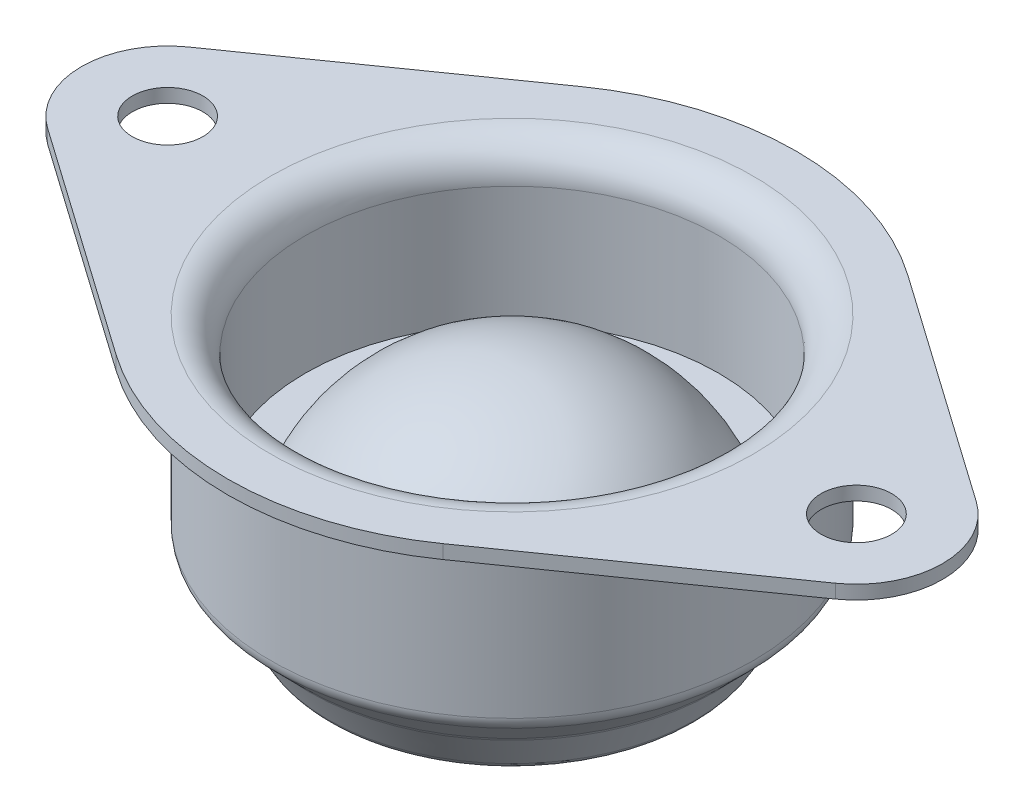
ISO-10303-21;
HEADER;
FILE_DESCRIPTION(('STEP AP214'),'2;1');
FILE_NAME('part.step','',(''),(''),'','','');
FILE_SCHEMA(('AUTOMOTIVE_DESIGN { 1 0 10303 214 1 1 1 1 }'));
ENDSEC;
DATA;
#1=APPLICATION_CONTEXT('core data for automotive mechanical design processes');
#2=APPLICATION_PROTOCOL_DEFINITION('international standard','automotive_design',2000,#1);
#3=PRODUCT_CONTEXT('',#1,'mechanical');
#4=PRODUCT('Part','Part','',(#3));
#5=PRODUCT_RELATED_PRODUCT_CATEGORY('part','',(#4));
#6=PRODUCT_DEFINITION_FORMATION('','',#4);
#7=PRODUCT_DEFINITION_CONTEXT('part definition',#1,'design');
#8=PRODUCT_DEFINITION('design','',#6,#7);
#9=PRODUCT_DEFINITION_SHAPE('','',#8);
#10=(LENGTH_UNIT() NAMED_UNIT(*) SI_UNIT(.MILLI.,.METRE.));
#11=(NAMED_UNIT(*) PLANE_ANGLE_UNIT() SI_UNIT($,.RADIAN.));
#12=(NAMED_UNIT(*) SI_UNIT($,.STERADIAN.) SOLID_ANGLE_UNIT());
#13=UNCERTAINTY_MEASURE_WITH_UNIT(LENGTH_MEASURE(1.E-05),#10,'distance_accuracy_value','');
#14=(GEOMETRIC_REPRESENTATION_CONTEXT(3) GLOBAL_UNCERTAINTY_ASSIGNED_CONTEXT((#13)) GLOBAL_UNIT_ASSIGNED_CONTEXT((#10,
#11,#12)) REPRESENTATION_CONTEXT('',''));
#15=CARTESIAN_POINT('',(0.,0.,0.));
#16=DIRECTION('',(0.,0.,1.));
#17=DIRECTION('',(1.,0.,0.));
#18=AXIS2_PLACEMENT_3D('',#15,#16,#17);
#19=CARTESIAN_POINT('',(12.,2.5,0.));
#20=DIRECTION('',(0.,-1.,0.));
#21=DIRECTION('',(1.,0.,0.));
#22=AXIS2_PLACEMENT_3D('',#19,#20,#21);
#23=PLANE('',#22);
#24=CARTESIAN_POINT('',(-20.,2.49999999999999,0.));
#25=DIRECTION('',(0.,1.,0.));
#26=DIRECTION('',(-1.,0.,0.));
#27=AXIS2_PLACEMENT_3D('',#24,#25,#26);
#28=CIRCLE('',#27,5.);
#29=CARTESIAN_POINT('',(-22.875,2.49999999999999,-4.09076704298841));
#30=VERTEX_POINT('',#29);
#31=CARTESIAN_POINT('',(-22.875,2.49999999999999,4.09076704298838));
#32=VERTEX_POINT('',#31);
#33=EDGE_CURVE('E237',#30,#32,#28,.T.);
#34=ORIENTED_EDGE('',*,*,#33,.T.);
#35=DIRECTION('',(0.81815340859768,0.,0.575));
#36=VECTOR('',#35,1.);
#37=CARTESIAN_POINT('',(-9.4875,2.49999999999999,13.4995312418617));
#38=LINE('',#37,#36);
#39=CARTESIAN_POINT('',(-9.4875,2.49999999999999,13.4995312418617));
#40=VERTEX_POINT('',#39);
#41=EDGE_CURVE('E193',#32,#40,#38,.T.);
#42=ORIENTED_EDGE('',*,*,#41,.T.);
#43=CARTESIAN_POINT('',(0.,2.49999999999999,0.));
#44=DIRECTION('',(0.,1.,0.));
#45=DIRECTION('',(-1.,0.,0.));
#46=AXIS2_PLACEMENT_3D('',#43,#44,#45);
#47=CIRCLE('',#46,16.5);
#48=CARTESIAN_POINT('',(9.4875,2.5,13.4995312418617));
#49=VERTEX_POINT('',#48);
#50=EDGE_CURVE('E422',#40,#49,#47,.T.);
#51=ORIENTED_EDGE('',*,*,#50,.T.);
#52=DIRECTION('',(-0.81815340859768,0.,0.574999999999999));
#53=VECTOR('',#52,1.);
#54=CARTESIAN_POINT('',(9.4875,2.5,13.4995312418617));
#55=LINE('',#54,#53);
#56=CARTESIAN_POINT('',(22.875,2.5,4.09076704298839));
#57=VERTEX_POINT('',#56);
#58=EDGE_CURVE('E212',#57,#49,#55,.T.);
#59=ORIENTED_EDGE('',*,*,#58,.F.);
#60=CARTESIAN_POINT('',(20.,2.5,0.));
#61=DIRECTION('',(0.,1.,0.));
#62=DIRECTION('',(-1.,0.,0.));
#63=AXIS2_PLACEMENT_3D('',#60,#61,#62);
#64=CIRCLE('',#63,5.);
#65=CARTESIAN_POINT('',(22.875,2.5,-4.0907670429884));
#66=VERTEX_POINT('',#65);
#67=EDGE_CURVE('E234',#66,#57,#64,.F.);
#68=ORIENTED_EDGE('',*,*,#67,.F.);
#69=DIRECTION('',(-0.81815340859768,0.,-0.575));
#70=VECTOR('',#69,1.);
#71=CARTESIAN_POINT('',(9.4875,2.5,-13.4995312418617));
#72=LINE('',#71,#70);
#73=CARTESIAN_POINT('',(9.4875,2.5,-13.4995312418617));
#74=VERTEX_POINT('',#73);
#75=EDGE_CURVE('E184',#66,#74,#72,.T.);
#76=ORIENTED_EDGE('',*,*,#75,.T.);
#77=CARTESIAN_POINT('',(0.,2.49999999999999,0.));
#78=DIRECTION('',(0.,1.,0.));
#79=DIRECTION('',(-1.,0.,0.));
#80=AXIS2_PLACEMENT_3D('',#77,#78,#79);
#81=CIRCLE('',#80,16.5);
#82=CARTESIAN_POINT('',(-9.48750000000002,2.49999999999999,-13.4995312418617));
#83=VERTEX_POINT('',#82);
#84=EDGE_CURVE('E243',#74,#83,#81,.T.);
#85=ORIENTED_EDGE('',*,*,#84,.T.);
#86=DIRECTION('',(0.81815340859768,0.,-0.574999999999999));
#87=VECTOR('',#86,1.);
#88=CARTESIAN_POINT('',(-9.48750000000002,2.49999999999999,-13.4995312418617));
#89=LINE('',#88,#87);
#90=EDGE_CURVE('E240',#30,#83,#89,.T.);
#91=ORIENTED_EDGE('',*,*,#90,.F.);
#92=EDGE_LOOP('',(#34,#42,#51,#59,#68,#76,#85,#91));
#93=FACE_BOUND('',#92,.T.);
#94=CARTESIAN_POINT('',(0.,2.49999999999999,0.));
#95=DIRECTION('',(0.,-1.,0.));
#96=DIRECTION('',(1.,0.,0.));
#97=AXIS2_PLACEMENT_3D('',#94,#95,#96);
#98=CIRCLE('',#97,14.);
#99=CARTESIAN_POINT('',(14.,2.49999999999999,0.));
#100=VERTEX_POINT('',#99);
#101=EDGE_CURVE('E14',#100,#100,#98,.T.);
#102=ORIENTED_EDGE('',*,*,#101,.T.);
#103=EDGE_LOOP('',(#102));
#104=FACE_BOUND('',#103,.T.);
#105=CARTESIAN_POINT('',(-20.,2.49999999999999,0.));
#106=DIRECTION('',(0.,1.,0.));
#107=DIRECTION('',(0.,0.,1.));
#108=AXIS2_PLACEMENT_3D('',#105,#106,#107);
#109=CIRCLE('',#108,2.04999999999999);
#110=CARTESIAN_POINT('',(-20.,2.49999999999999,2.04999999999998));
#111=VERTEX_POINT('',#110);
#112=EDGE_CURVE('E208',#111,#111,#109,.T.);
#113=ORIENTED_EDGE('',*,*,#112,.F.);
#114=EDGE_LOOP('',(#113));
#115=FACE_BOUND('',#114,.T.);
#116=CARTESIAN_POINT('',(20.,2.5,0.));
#117=DIRECTION('',(0.,1.,0.));
#118=DIRECTION('',(0.,0.,1.));
#119=AXIS2_PLACEMENT_3D('',#116,#117,#118);
#120=CIRCLE('',#119,2.04999999999999);
#121=CARTESIAN_POINT('',(20.,2.5,2.04999999999998));
#122=VERTEX_POINT('',#121);
#123=EDGE_CURVE('E411',#122,#122,#120,.T.);
#124=ORIENTED_EDGE('',*,*,#123,.F.);
#125=EDGE_LOOP('',(#124));
#126=FACE_BOUND('',#125,.T.);
#127=ADVANCED_FACE('F90',(#93,#104,#115,#126),#23,.F.);
#128=CARTESIAN_POINT('',(0.,-10.4213203435596,0.));
#129=DIRECTION('',(0.,1.,0.));
#130=DIRECTION('',(-1.,0.,0.));
#131=AXIS2_PLACEMENT_3D('',#128,#129,#130);
#132=CONICAL_SURFACE('',#131,11.8786796564404,0.785398163397454);
#133=CARTESIAN_POINT('',(0.,-10.3282279697554,0.));
#134=DIRECTION('',(0.,1.,0.));
#135=DIRECTION('',(-1.,0.,0.));
#136=AXIS2_PLACEMENT_3D('',#133,#134,#135);
#137=CIRCLE('',#136,11.9717720302446);
#138=CARTESIAN_POINT('',(-11.9717720302446,-10.3282279697554,0.));
#139=VERTEX_POINT('',#138);
#140=EDGE_CURVE('E292',#139,#139,#137,.T.);
#141=ORIENTED_EDGE('',*,*,#140,.T.);
#142=EDGE_LOOP('',(#141));
#143=FACE_BOUND('',#142,.T.);
#144=CARTESIAN_POINT('',(0.,-8.59289321881346,0.));
#145=DIRECTION('',(0.,-1.,0.));
#146=DIRECTION('',(1.,0.,0.));
#147=AXIS2_PLACEMENT_3D('',#144,#145,#146);
#148=CIRCLE('',#147,13.7071067811866);
#149=CARTESIAN_POINT('',(13.7071067811866,-8.59289321881346,0.));
#150=VERTEX_POINT('',#149);
#151=EDGE_CURVE('E288',#150,#150,#148,.T.);
#152=ORIENTED_EDGE('',*,*,#151,.T.);
#153=EDGE_LOOP('',(#152));
#154=FACE_BOUND('',#153,.T.);
#155=ADVANCED_FACE('F329',(#143,#154),#132,.T.);
#156=CARTESIAN_POINT('',(0.,-13.0193965549129,0.));
#157=DIRECTION('',(0.,1.,0.));
#158=DIRECTION('',(-1.,0.,0.));
#159=AXIS2_PLACEMENT_3D('',#156,#157,#158);
#160=CONICAL_SURFACE('',#159,10.3786796564403,0.523598775598304);
#161=CARTESIAN_POINT('',(0.,-12.5193965549129,0.));
#162=DIRECTION('',(0.,-1.,0.));
#163=DIRECTION('',(1.,0.,0.));
#164=AXIS2_PLACEMENT_3D('',#161,#162,#163);
#165=CIRCLE('',#164,10.6673547910352);
#166=CARTESIAN_POINT('',(10.6673547910352,-12.5193965549129,0.));
#167=VERTEX_POINT('',#166);
#168=EDGE_CURVE('E284',#167,#167,#165,.F.);
#169=ORIENTED_EDGE('',*,*,#168,.T.);
#170=EDGE_LOOP('',(#169));
#171=FACE_BOUND('',#170,.T.);
#172=CARTESIAN_POINT('',(0.,-10.535334750942,0.));
#173=DIRECTION('',(0.,1.,0.));
#174=DIRECTION('',(-1.,0.,0.));
#175=AXIS2_PLACEMENT_3D('',#172,#173,#174);
#176=CIRCLE('',#175,11.8128534076467);
#177=CARTESIAN_POINT('',(-11.8128534076467,-10.535334750942,0.));
#178=VERTEX_POINT('',#177);
#179=EDGE_CURVE('E280',#178,#178,#176,.F.);
#180=ORIENTED_EDGE('',*,*,#179,.T.);
#181=EDGE_LOOP('',(#180));
#182=FACE_BOUND('',#181,.T.);
#183=ADVANCED_FACE('F335',(#171,#182),#160,.T.);
#184=CARTESIAN_POINT('',(7.22302135909939,-13.0193965549129,0.));
#185=DIRECTION('',(0.,1.,0.));
#186=DIRECTION('',(-1.,0.,0.));
#187=AXIS2_PLACEMENT_3D('',#184,#185,#186);
#188=PLANE('',#187);
#189=CARTESIAN_POINT('',(0.,-13.0193965549129,0.));
#190=DIRECTION('',(0.,1.,0.));
#191=DIRECTION('',(-1.,0.,0.));
#192=AXIS2_PLACEMENT_3D('',#189,#190,#191);
#193=CIRCLE('',#192,7.94564311079851);
#194=CARTESIAN_POINT('',(-7.94564311079851,-13.0193965549129,0.));
#195=VERTEX_POINT('',#194);
#196=EDGE_CURVE('E272',#195,#195,#193,.T.);
#197=ORIENTED_EDGE('',*,*,#196,.T.);
#198=EDGE_LOOP('',(#197));
#199=FACE_BOUND('',#198,.T.);
#200=CARTESIAN_POINT('',(0.,-13.0193965549129,0.));
#201=DIRECTION('',(0.,1.,0.));
#202=DIRECTION('',(-1.,0.,0.));
#203=AXIS2_PLACEMENT_3D('',#200,#201,#202);
#204=CIRCLE('',#203,9.80132938725072);
#205=CARTESIAN_POINT('',(-9.80132938725073,-13.0193965549129,0.));
#206=VERTEX_POINT('',#205);
#207=EDGE_CURVE('E268',#206,#206,#204,.F.);
#208=ORIENTED_EDGE('',*,*,#207,.T.);
#209=EDGE_LOOP('',(#208));
#210=FACE_BOUND('',#209,.T.);
#211=ADVANCED_FACE('F355',(#199,#210),#188,.F.);
#212=CARTESIAN_POINT('',(0.,-11.,0.));
#213=DIRECTION('',(0.,1.,0.));
#214=DIRECTION('',(-1.,0.,0.));
#215=AXIS2_PLACEMENT_3D('',#212,#213,#214);
#216=SPHERICAL_SURFACE('',#215,7.5);
#217=CARTESIAN_POINT('',(0.,-13.6641734308055,0.));
#218=DIRECTION('',(0.,1.,0.));
#219=DIRECTION('',(-1.,0.,0.));
#220=AXIS2_PLACEMENT_3D('',#217,#218,#219);
#221=CIRCLE('',#220,7.01086156835163);
#222=CARTESIAN_POINT('',(-7.01086156835163,-13.6641734308055,0.));
#223=VERTEX_POINT('',#222);
#224=EDGE_CURVE('E276',#223,#223,#221,.F.);
#225=ORIENTED_EDGE('',*,*,#224,.T.);
#226=EDGE_LOOP('',(#225));
#227=FACE_BOUND('',#226,.T.);
#228=ADVANCED_FACE('F351',(#227),#216,.T.);
#229=CARTESIAN_POINT('',(0.,-11.,0.));
#230=DIRECTION('',(0.,1.,0.));
#231=DIRECTION('',(1.,0.,0.));
#232=AXIS2_PLACEMENT_3D('',#229,#230,#231);
#233=SPHERICAL_SURFACE('',#232,11.);
#234=CARTESIAN_POINT('',(0.,-6.41742430504415,0.));
#235=DIRECTION('',(0.,1.,0.));
#236=DIRECTION('',(-1.,0.,0.));
#237=AXIS2_PLACEMENT_3D('',#234,#235,#236);
#238=CIRCLE('',#237,10.);
#239=CARTESIAN_POINT('',(-10.,-6.41742430504415,0.));
#240=VERTEX_POINT('',#239);
#241=EDGE_CURVE('E264',#240,#240,#238,.T.);
#242=ORIENTED_EDGE('',*,*,#241,.T.);
#243=EDGE_LOOP('',(#242));
#244=FACE_BOUND('',#243,.T.);
#245=ADVANCED_FACE('F347',(#244),#233,.T.);
#246=CARTESIAN_POINT('',(12.,-6.41742430504415,0.));
#247=DIRECTION('',(0.,-1.,0.));
#248=DIRECTION('',(1.,0.,0.));
#249=AXIS2_PLACEMENT_3D('',#246,#247,#248);
#250=PLANE('',#249);
#251=ORIENTED_EDGE('',*,*,#241,.F.);
#252=EDGE_LOOP('',(#251));
#253=FACE_BOUND('',#252,.T.);
#254=CARTESIAN_POINT('',(0.,-6.41742430504415,0.));
#255=DIRECTION('',(0.,1.,0.));
#256=DIRECTION('',(-1.,0.,0.));
#257=AXIS2_PLACEMENT_3D('',#254,#255,#256);
#258=CIRCLE('',#257,12.);
#259=CARTESIAN_POINT('',(-12.,-6.41742430504415,0.));
#260=VERTEX_POINT('',#259);
#261=EDGE_CURVE('E260',#260,#260,#258,.T.);
#262=ORIENTED_EDGE('',*,*,#261,.T.);
#263=EDGE_LOOP('',(#262));
#264=FACE_BOUND('',#263,.T.);
#265=ADVANCED_FACE('F344',(#253,#264),#250,.F.);
#266=CARTESIAN_POINT('',(0.,43.2986827865185,0.));
#267=DIRECTION('',(0.,1.,0.));
#268=DIRECTION('',(-1.,0.,0.));
#269=AXIS2_PLACEMENT_3D('',#266,#267,#268);
#270=CYLINDRICAL_SURFACE('',#269,12.);
#271=CARTESIAN_POINT('',(0.,0.5,0.));
#272=DIRECTION('',(0.,-1.,0.));
#273=DIRECTION('',(1.,0.,0.));
#274=AXIS2_PLACEMENT_3D('',#271,#272,#273);
#275=CIRCLE('',#274,12.);
#276=CARTESIAN_POINT('',(12.,0.500000000000002,0.));
#277=VERTEX_POINT('',#276);
#278=EDGE_CURVE('E99',#277,#277,#275,.F.);
#279=ORIENTED_EDGE('',*,*,#278,.T.);
#280=EDGE_LOOP('',(#279));
#281=FACE_BOUND('',#280,.T.);
#282=ORIENTED_EDGE('',*,*,#261,.F.);
#283=EDGE_LOOP('',(#282));
#284=FACE_BOUND('',#283,.T.);
#285=ADVANCED_FACE('F311',(#281,#284),#270,.F.);
#286=CARTESIAN_POINT('',(14.,1.69999999999999,0.));
#287=DIRECTION('',(0.,1.,0.));
#288=DIRECTION('',(-1.,0.,0.));
#289=AXIS2_PLACEMENT_3D('',#286,#287,#288);
#290=PLANE('',#289);
#291=CARTESIAN_POINT('',(20.,1.69999999999999,0.));
#292=DIRECTION('',(0.,1.,0.));
#293=DIRECTION('',(-1.,0.,0.));
#294=AXIS2_PLACEMENT_3D('',#291,#292,#293);
#295=CIRCLE('',#294,2.04999999999999);
#296=CARTESIAN_POINT('',(17.95,1.69999999999999,0.));
#297=VERTEX_POINT('',#296);
#298=EDGE_CURVE('E396',#297,#297,#295,.T.);
#299=ORIENTED_EDGE('',*,*,#298,.T.);
#300=EDGE_LOOP('',(#299));
#301=FACE_BOUND('',#300,.T.);
#302=CARTESIAN_POINT('',(-20.,1.69999999999999,0.));
#303=DIRECTION('',(0.,1.,0.));
#304=DIRECTION('',(-1.,0.,0.));
#305=AXIS2_PLACEMENT_3D('',#302,#303,#304);
#306=CIRCLE('',#305,2.04999999999999);
#307=CARTESIAN_POINT('',(-22.05,1.69999999999999,0.));
#308=VERTEX_POINT('',#307);
#309=EDGE_CURVE('E202',#308,#308,#306,.T.);
#310=ORIENTED_EDGE('',*,*,#309,.T.);
#311=EDGE_LOOP('',(#310));
#312=FACE_BOUND('',#311,.T.);
#313=DIRECTION('',(-0.81815340859768,0.,-0.575));
#314=VECTOR('',#313,1.);
#315=CARTESIAN_POINT('',(-9.4875,1.69999999999999,13.4995312418617));
#316=LINE('',#315,#314);
#317=CARTESIAN_POINT('',(-9.4875,1.69999999999999,13.4995312418617));
#318=VERTEX_POINT('',#317);
#319=CARTESIAN_POINT('',(-22.875,1.69999999999999,4.09076704298838));
#320=VERTEX_POINT('',#319);
#321=EDGE_CURVE('E190',#318,#320,#316,.T.);
#322=ORIENTED_EDGE('',*,*,#321,.T.);
#323=CARTESIAN_POINT('',(-20.,1.69999999999999,0.));
#324=DIRECTION('',(0.,1.,0.));
#325=DIRECTION('',(-1.,0.,0.));
#326=AXIS2_PLACEMENT_3D('',#323,#324,#325);
#327=CIRCLE('',#326,5.);
#328=CARTESIAN_POINT('',(-22.875,1.69999999999999,-4.09076704298841));
#329=VERTEX_POINT('',#328);
#330=EDGE_CURVE('E173',#320,#329,#327,.F.);
#331=ORIENTED_EDGE('',*,*,#330,.T.);
#332=DIRECTION('',(-0.81815340859768,0.,0.574999999999999));
#333=VECTOR('',#332,1.);
#334=CARTESIAN_POINT('',(-9.48750000000002,1.69999999999999,-13.4995312418617));
#335=LINE('',#334,#333);
#336=CARTESIAN_POINT('',(-9.48750000000002,1.69999999999999,-13.4995312418617));
#337=VERTEX_POINT('',#336);
#338=EDGE_CURVE('E185',#337,#329,#335,.T.);
#339=ORIENTED_EDGE('',*,*,#338,.F.);
#340=CARTESIAN_POINT('',(0.,1.69999999999999,0.));
#341=DIRECTION('',(0.,1.,0.));
#342=DIRECTION('',(-1.,0.,0.));
#343=AXIS2_PLACEMENT_3D('',#340,#341,#342);
#344=CIRCLE('',#343,16.5);
#345=CARTESIAN_POINT('',(9.4875,1.69999999999999,-13.4995312418617));
#346=VERTEX_POINT('',#345);
#347=EDGE_CURVE('E225',#337,#346,#344,.F.);
#348=ORIENTED_EDGE('',*,*,#347,.T.);
#349=DIRECTION('',(0.81815340859768,0.,0.575));
#350=VECTOR('',#349,1.);
#351=CARTESIAN_POINT('',(9.4875,1.69999999999999,-13.4995312418617));
#352=LINE('',#351,#350);
#353=CARTESIAN_POINT('',(22.875,1.70000000000001,-4.09076704298839));
#354=VERTEX_POINT('',#353);
#355=EDGE_CURVE('E221',#346,#354,#352,.T.);
#356=ORIENTED_EDGE('',*,*,#355,.T.);
#357=CARTESIAN_POINT('',(20.,1.70000000000001,0.));
#358=DIRECTION('',(0.,1.,0.));
#359=DIRECTION('',(-1.,0.,0.));
#360=AXIS2_PLACEMENT_3D('',#357,#358,#359);
#361=CIRCLE('',#360,5.);
#362=CARTESIAN_POINT('',(22.875,1.70000000000001,4.09076704298839));
#363=VERTEX_POINT('',#362);
#364=EDGE_CURVE('E250',#363,#354,#361,.T.);
#365=ORIENTED_EDGE('',*,*,#364,.F.);
#366=DIRECTION('',(0.81815340859768,0.,-0.574999999999999));
#367=VECTOR('',#366,1.);
#368=CARTESIAN_POINT('',(9.4875,1.69999999999999,13.4995312418617));
#369=LINE('',#368,#367);
#370=CARTESIAN_POINT('',(9.4875,1.69999999999999,13.4995312418617));
#371=VERTEX_POINT('',#370);
#372=EDGE_CURVE('E217',#371,#363,#369,.T.);
#373=ORIENTED_EDGE('',*,*,#372,.F.);
#374=CARTESIAN_POINT('',(0.,1.69999999999999,0.));
#375=DIRECTION('',(0.,1.,0.));
#376=DIRECTION('',(-1.,0.,0.));
#377=AXIS2_PLACEMENT_3D('',#374,#375,#376);
#378=CIRCLE('',#377,16.5);
#379=EDGE_CURVE('E200',#371,#318,#378,.F.);
#380=ORIENTED_EDGE('',*,*,#379,.T.);
#381=EDGE_LOOP('',(#322,#331,#339,#348,#356,#365,#373,#380));
#382=FACE_BOUND('',#381,.T.);
#383=CARTESIAN_POINT('',(0.,1.69999999999999,0.));
#384=DIRECTION('',(0.,1.,0.));
#385=DIRECTION('',(-1.,0.,0.));
#386=AXIS2_PLACEMENT_3D('',#383,#384,#385);
#387=CIRCLE('',#386,15.);
#388=CARTESIAN_POINT('',(-15.,1.69999999999999,0.));
#389=VERTEX_POINT('',#388);
#390=EDGE_CURVE('E304',#389,#389,#387,.T.);
#391=ORIENTED_EDGE('',*,*,#390,.T.);
#392=EDGE_LOOP('',(#391));
#393=FACE_BOUND('',#392,.T.);
#394=ADVANCED_FACE('F196',(#301,#312,#382,#393),#290,.F.);
#395=CARTESIAN_POINT('',(0.,43.2986827865185,0.));
#396=DIRECTION('',(0.,1.,0.));
#397=DIRECTION('',(-1.,0.,0.));
#398=AXIS2_PLACEMENT_3D('',#395,#396,#397);
#399=CYLINDRICAL_SURFACE('',#398,14.);
#400=CARTESIAN_POINT('',(0.,-7.8857864376269,0.));
#401=DIRECTION('',(0.,-1.,0.));
#402=DIRECTION('',(1.,0.,0.));
#403=AXIS2_PLACEMENT_3D('',#400,#401,#402);
#404=CIRCLE('',#403,14.);
#405=CARTESIAN_POINT('',(14.,-7.8857864376269,0.));
#406=VERTEX_POINT('',#405);
#407=EDGE_CURVE('E300',#406,#406,#404,.F.);
#408=ORIENTED_EDGE('',*,*,#407,.T.);
#409=EDGE_LOOP('',(#408));
#410=FACE_BOUND('',#409,.T.);
#411=CARTESIAN_POINT('',(0.,0.699999999999992,0.));
#412=DIRECTION('',(0.,1.,0.));
#413=DIRECTION('',(-1.,0.,0.));
#414=AXIS2_PLACEMENT_3D('',#411,#412,#413);
#415=CIRCLE('',#414,14.);
#416=CARTESIAN_POINT('',(-14.,0.69999999999999,0.));
#417=VERTEX_POINT('',#416);
#418=EDGE_CURVE('E296',#417,#417,#415,.F.);
#419=ORIENTED_EDGE('',*,*,#418,.T.);
#420=EDGE_LOOP('',(#419));
#421=FACE_BOUND('',#420,.T.);
#422=ADVANCED_FACE('F367',(#410,#421),#399,.T.);
#423=CARTESIAN_POINT('',(0.,-14.0193965549129,0.));
#424=DIRECTION('',(0.,1.,0.));
#425=DIRECTION('',(-1.,0.,0.));
#426=AXIS2_PLACEMENT_3D('',#423,#424,#425);
#427=TOROIDAL_SURFACE('',#426,7.94564311079851,1.);
#428=ORIENTED_EDGE('',*,*,#224,.F.);
#429=EDGE_LOOP('',(#428));
#430=FACE_BOUND('',#429,.T.);
#431=ORIENTED_EDGE('',*,*,#196,.F.);
#432=EDGE_LOOP('',(#431));
#433=FACE_BOUND('',#432,.T.);
#434=ADVANCED_FACE('F363',(#430,#433),#427,.F.);
#435=CARTESIAN_POINT('',(0.,-12.0193965549129,0.));
#436=DIRECTION('',(0.,1.,0.));
#437=DIRECTION('',(-1.,0.,0.));
#438=AXIS2_PLACEMENT_3D('',#435,#436,#437);
#439=TOROIDAL_SURFACE('',#438,9.80132938725072,1.);
#440=ORIENTED_EDGE('',*,*,#207,.F.);
#441=EDGE_LOOP('',(#440));
#442=FACE_BOUND('',#441,.T.);
#443=ORIENTED_EDGE('',*,*,#168,.F.);
#444=EDGE_LOOP('',(#443));
#445=FACE_BOUND('',#444,.T.);
#446=ADVANCED_FACE('F366',(#442,#445),#439,.T.);
#447=CARTESIAN_POINT('',(0.,-11.035334750942,0.));
#448=DIRECTION('',(0.,1.,0.));
#449=DIRECTION('',(-1.,0.,0.));
#450=AXIS2_PLACEMENT_3D('',#447,#448,#449);
#451=TOROIDAL_SURFACE('',#450,12.6788788114311,1.);
#452=ORIENTED_EDGE('',*,*,#179,.F.);
#453=EDGE_LOOP('',(#452));
#454=FACE_BOUND('',#453,.T.);
#455=ORIENTED_EDGE('',*,*,#140,.F.);
#456=EDGE_LOOP('',(#455));
#457=FACE_BOUND('',#456,.T.);
#458=ADVANCED_FACE('F371',(#454,#457),#451,.F.);
#459=CARTESIAN_POINT('',(0.,-7.88578643762691,0.));
#460=DIRECTION('',(0.,-1.,0.));
#461=DIRECTION('',(1.,0.,0.));
#462=AXIS2_PLACEMENT_3D('',#459,#460,#461);
#463=TOROIDAL_SURFACE('',#462,13.,1.);
#464=ORIENTED_EDGE('',*,*,#151,.F.);
#465=EDGE_LOOP('',(#464));
#466=FACE_BOUND('',#465,.T.);
#467=ORIENTED_EDGE('',*,*,#407,.F.);
#468=EDGE_LOOP('',(#467));
#469=FACE_BOUND('',#468,.T.);
#470=ADVANCED_FACE('F325',(#466,#469),#463,.T.);
#471=CARTESIAN_POINT('',(0.,0.699999999999992,0.));
#472=DIRECTION('',(0.,1.,0.));
#473=DIRECTION('',(-1.,0.,0.));
#474=AXIS2_PLACEMENT_3D('',#471,#472,#473);
#475=TOROIDAL_SURFACE('',#474,15.,1.);
#476=ORIENTED_EDGE('',*,*,#418,.F.);
#477=EDGE_LOOP('',(#476));
#478=FACE_BOUND('',#477,.T.);
#479=ORIENTED_EDGE('',*,*,#390,.F.);
#480=EDGE_LOOP('',(#479));
#481=FACE_BOUND('',#480,.T.);
#482=ADVANCED_FACE('F316',(#478,#481),#475,.F.);
#483=CARTESIAN_POINT('',(0.,0.5,0.));
#484=DIRECTION('',(0.,-1.,0.));
#485=DIRECTION('',(1.,0.,0.));
#486=AXIS2_PLACEMENT_3D('',#483,#484,#485);
#487=TOROIDAL_SURFACE('',#486,14.,2.);
#488=ORIENTED_EDGE('',*,*,#101,.F.);
#489=EDGE_LOOP('',(#488));
#490=FACE_BOUND('',#489,.T.);
#491=ORIENTED_EDGE('',*,*,#278,.F.);
#492=EDGE_LOOP('',(#491));
#493=FACE_BOUND('',#492,.T.);
#494=ADVANCED_FACE('F92',(#490,#493),#487,.T.);
#495=CARTESIAN_POINT('',(9.4875,-18.501,-13.4995312418617));
#496=DIRECTION('',(0.575,0.,-0.818153408597679));
#497=DIRECTION('',(-0.81815340859768,0.,-0.575));
#498=AXIS2_PLACEMENT_3D('',#495,#496,#497);
#499=PLANE('',#498);
#500=DIRECTION('',(0.,1.,0.));
#501=VECTOR('',#500,1.);
#502=CARTESIAN_POINT('',(9.48750000000001,-18.501,-13.4995312418617));
#503=LINE('',#502,#501);
#504=EDGE_CURVE('E109',#346,#74,#503,.T.);
#505=ORIENTED_EDGE('',*,*,#504,.T.);
#506=ORIENTED_EDGE('',*,*,#75,.F.);
#507=DIRECTION('',(0.,1.,0.));
#508=VECTOR('',#507,1.);
#509=CARTESIAN_POINT('',(22.875,-18.501,-4.0907670429884));
#510=LINE('',#509,#508);
#511=EDGE_CURVE('E247',#354,#66,#510,.T.);
#512=ORIENTED_EDGE('',*,*,#511,.F.);
#513=ORIENTED_EDGE('',*,*,#355,.F.);
#514=EDGE_LOOP('',(#505,#506,#512,#513));
#515=FACE_BOUND('',#514,.T.);
#516=ADVANCED_FACE('F315',(#515),#499,.T.);
#517=CARTESIAN_POINT('',(0.,-18.501,0.));
#518=DIRECTION('',(0.,1.,0.));
#519=DIRECTION('',(-1.,0.,0.));
#520=AXIS2_PLACEMENT_3D('',#517,#518,#519);
#521=CYLINDRICAL_SURFACE('',#520,16.5);
#522=DIRECTION('',(0.,1.,0.));
#523=VECTOR('',#522,1.);
#524=CARTESIAN_POINT('',(-9.4875,-18.501,-13.4995312418617));
#525=LINE('',#524,#523);
#526=EDGE_CURVE('E119',#337,#83,#525,.T.);
#527=ORIENTED_EDGE('',*,*,#526,.T.);
#528=ORIENTED_EDGE('',*,*,#84,.F.);
#529=ORIENTED_EDGE('',*,*,#504,.F.);
#530=ORIENTED_EDGE('',*,*,#347,.F.);
#531=EDGE_LOOP('',(#527,#528,#529,#530));
#532=FACE_BOUND('',#531,.T.);
#533=ADVANCED_FACE('F322',(#532),#521,.T.);
#534=CARTESIAN_POINT('',(-9.4875,-18.501,-13.4995312418617));
#535=DIRECTION('',(0.575,0.,0.818153408597679));
#536=DIRECTION('',(0.81815340859768,0.,-0.574999999999999));
#537=AXIS2_PLACEMENT_3D('',#534,#535,#536);
#538=PLANE('',#537);
#539=ORIENTED_EDGE('',*,*,#338,.T.);
#540=DIRECTION('',(0.,1.,0.));
#541=VECTOR('',#540,1.);
#542=CARTESIAN_POINT('',(-22.875,-18.501,-4.09076704298841));
#543=LINE('',#542,#541);
#544=EDGE_CURVE('E179',#329,#30,#543,.T.);
#545=ORIENTED_EDGE('',*,*,#544,.T.);
#546=ORIENTED_EDGE('',*,*,#90,.T.);
#547=ORIENTED_EDGE('',*,*,#526,.F.);
#548=EDGE_LOOP('',(#539,#545,#546,#547));
#549=FACE_BOUND('',#548,.T.);
#550=ADVANCED_FACE('F455',(#549),#538,.F.);
#551=CARTESIAN_POINT('',(-20.,-18.501,0.));
#552=DIRECTION('',(0.,1.,0.));
#553=DIRECTION('',(-1.,0.,0.));
#554=AXIS2_PLACEMENT_3D('',#551,#552,#553);
#555=CYLINDRICAL_SURFACE('',#554,5.);
#556=ORIENTED_EDGE('',*,*,#330,.F.);
#557=DIRECTION('',(0.,1.,0.));
#558=VECTOR('',#557,1.);
#559=CARTESIAN_POINT('',(-22.875,-18.501,4.09076704298838));
#560=LINE('',#559,#558);
#561=EDGE_CURVE('E177',#320,#32,#560,.T.);
#562=ORIENTED_EDGE('',*,*,#561,.T.);
#563=ORIENTED_EDGE('',*,*,#33,.F.);
#564=ORIENTED_EDGE('',*,*,#544,.F.);
#565=EDGE_LOOP('',(#556,#562,#563,#564));
#566=FACE_BOUND('',#565,.T.);
#567=ADVANCED_FACE('F175',(#566),#555,.T.);
#568=CARTESIAN_POINT('',(20.,-18.501,0.));
#569=DIRECTION('',(0.,1.,0.));
#570=DIRECTION('',(-1.,0.,0.));
#571=AXIS2_PLACEMENT_3D('',#568,#569,#570);
#572=CYLINDRICAL_SURFACE('',#571,5.);
#573=ORIENTED_EDGE('',*,*,#364,.T.);
#574=ORIENTED_EDGE('',*,*,#511,.T.);
#575=ORIENTED_EDGE('',*,*,#67,.T.);
#576=DIRECTION('',(0.,1.,0.));
#577=VECTOR('',#576,1.);
#578=CARTESIAN_POINT('',(22.875,-18.501,4.09076704298839));
#579=LINE('',#578,#577);
#580=EDGE_CURVE('E415',#363,#57,#579,.T.);
#581=ORIENTED_EDGE('',*,*,#580,.F.);
#582=EDGE_LOOP('',(#573,#574,#575,#581));
#583=FACE_BOUND('',#582,.T.);
#584=ADVANCED_FACE('F452',(#583),#572,.T.);
#585=CARTESIAN_POINT('',(-9.4875,-18.501,13.4995312418617));
#586=DIRECTION('',(-0.575,0.,0.818153408597679));
#587=DIRECTION('',(0.81815340859768,0.,0.575));
#588=AXIS2_PLACEMENT_3D('',#585,#586,#587);
#589=PLANE('',#588);
#590=DIRECTION('',(0.,1.,0.));
#591=VECTOR('',#590,1.);
#592=CARTESIAN_POINT('',(-9.4875,-18.501,13.4995312418617));
#593=LINE('',#592,#591);
#594=EDGE_CURVE('E216',#318,#40,#593,.T.);
#595=ORIENTED_EDGE('',*,*,#594,.T.);
#596=ORIENTED_EDGE('',*,*,#41,.F.);
#597=ORIENTED_EDGE('',*,*,#561,.F.);
#598=ORIENTED_EDGE('',*,*,#321,.F.);
#599=EDGE_LOOP('',(#595,#596,#597,#598));
#600=FACE_BOUND('',#599,.T.);
#601=ADVANCED_FACE('F189',(#600),#589,.T.);
#602=CARTESIAN_POINT('',(0.,-18.501,0.));
#603=DIRECTION('',(0.,1.,0.));
#604=DIRECTION('',(-1.,0.,0.));
#605=AXIS2_PLACEMENT_3D('',#602,#603,#604);
#606=CYLINDRICAL_SURFACE('',#605,16.5);
#607=DIRECTION('',(0.,1.,0.));
#608=VECTOR('',#607,1.);
#609=CARTESIAN_POINT('',(9.48750000000002,-18.501,13.4995312418617));
#610=LINE('',#609,#608);
#611=EDGE_CURVE('E419',#371,#49,#610,.T.);
#612=ORIENTED_EDGE('',*,*,#611,.T.);
#613=ORIENTED_EDGE('',*,*,#50,.F.);
#614=ORIENTED_EDGE('',*,*,#594,.F.);
#615=ORIENTED_EDGE('',*,*,#379,.F.);
#616=EDGE_LOOP('',(#612,#613,#614,#615));
#617=FACE_BOUND('',#616,.T.);
#618=ADVANCED_FACE('F431',(#617),#606,.T.);
#619=CARTESIAN_POINT('',(9.48750000000002,-18.501,13.4995312418617));
#620=DIRECTION('',(-0.575,0.,-0.818153408597679));
#621=DIRECTION('',(-0.81815340859768,0.,0.574999999999999));
#622=AXIS2_PLACEMENT_3D('',#619,#620,#621);
#623=PLANE('',#622);
#624=ORIENTED_EDGE('',*,*,#372,.T.);
#625=ORIENTED_EDGE('',*,*,#580,.T.);
#626=ORIENTED_EDGE('',*,*,#58,.T.);
#627=ORIENTED_EDGE('',*,*,#611,.F.);
#628=EDGE_LOOP('',(#624,#625,#626,#627));
#629=FACE_BOUND('',#628,.T.);
#630=ADVANCED_FACE('F403',(#629),#623,.F.);
#631=CARTESIAN_POINT('',(-20.,2.49999999999999,0.));
#632=DIRECTION('',(0.,1.,0.));
#633=DIRECTION('',(0.,0.,1.));
#634=AXIS2_PLACEMENT_3D('',#631,#632,#633);
#635=CYLINDRICAL_SURFACE('',#634,2.04999999999999);
#636=ORIENTED_EDGE('',*,*,#309,.F.);
#637=EDGE_LOOP('',(#636));
#638=FACE_BOUND('',#637,.T.);
#639=ORIENTED_EDGE('',*,*,#112,.T.);
#640=EDGE_LOOP('',(#639));
#641=FACE_BOUND('',#640,.T.);
#642=ADVANCED_FACE('F399',(#638,#641),#635,.F.);
#643=CARTESIAN_POINT('',(20.,2.5,0.));
#644=DIRECTION('',(0.,1.,0.));
#645=DIRECTION('',(0.,0.,1.));
#646=AXIS2_PLACEMENT_3D('',#643,#644,#645);
#647=CYLINDRICAL_SURFACE('',#646,2.04999999999999);
#648=ORIENTED_EDGE('',*,*,#298,.F.);
#649=EDGE_LOOP('',(#648));
#650=FACE_BOUND('',#649,.T.);
#651=ORIENTED_EDGE('',*,*,#123,.T.);
#652=EDGE_LOOP('',(#651));
#653=FACE_BOUND('',#652,.T.);
#654=ADVANCED_FACE('F402',(#650,#653),#647,.F.);
#655=CLOSED_SHELL('',(#127,#155,#183,#211,#228,#245,#265,#285,#394,#422,#434,#446,#458,#470,
#482,#494,#516,#533,#550,#567,#584,#601,#618,#630,#642,#654));
#656=MANIFOLD_SOLID_BREP('B2',#655);
#657=ADVANCED_BREP_SHAPE_REPRESENTATION('',(#18,#656),#14);
#658=SHAPE_DEFINITION_REPRESENTATION(#9,#657);
ENDSEC;
END-ISO-10303-21;
